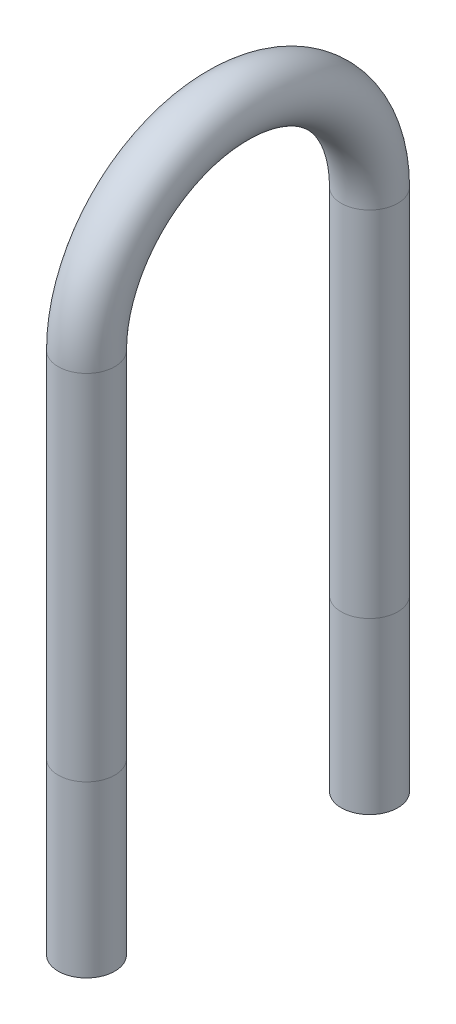
ISO-10303-21;
HEADER;
FILE_DESCRIPTION(('STEP AP214'),'2;1');
FILE_NAME('part.step','',(''),(''),'','','');
FILE_SCHEMA(('AUTOMOTIVE_DESIGN { 1 0 10303 214 1 1 1 1 }'));
ENDSEC;
DATA;
#1=APPLICATION_CONTEXT('core data for automotive mechanical design processes');
#2=APPLICATION_PROTOCOL_DEFINITION('international standard','automotive_design',2000,#1);
#3=PRODUCT_CONTEXT('',#1,'mechanical');
#4=PRODUCT('Part','Part','',(#3));
#5=PRODUCT_RELATED_PRODUCT_CATEGORY('part','',(#4));
#6=PRODUCT_DEFINITION_FORMATION('','',#4);
#7=PRODUCT_DEFINITION_CONTEXT('part definition',#1,'design');
#8=PRODUCT_DEFINITION('design','',#6,#7);
#9=PRODUCT_DEFINITION_SHAPE('','',#8);
#10=(LENGTH_UNIT() NAMED_UNIT(*) SI_UNIT(.MILLI.,.METRE.));
#11=(NAMED_UNIT(*) PLANE_ANGLE_UNIT() SI_UNIT($,.RADIAN.));
#12=(NAMED_UNIT(*) SI_UNIT($,.STERADIAN.) SOLID_ANGLE_UNIT());
#13=UNCERTAINTY_MEASURE_WITH_UNIT(LENGTH_MEASURE(1.E-05),#10,'distance_accuracy_value','');
#14=(GEOMETRIC_REPRESENTATION_CONTEXT(3) GLOBAL_UNCERTAINTY_ASSIGNED_CONTEXT((#13)) GLOBAL_UNIT_ASSIGNED_CONTEXT((#10,
#11,#12)) REPRESENTATION_CONTEXT('',''));
#15=CARTESIAN_POINT('',(0.,0.,0.));
#16=DIRECTION('',(0.,0.,1.));
#17=DIRECTION('',(1.,0.,0.));
#18=AXIS2_PLACEMENT_3D('',#15,#16,#17);
#19=CARTESIAN_POINT('',(0.,-152.4,-254.));
#20=DIRECTION('',(0.,1.,0.));
#21=DIRECTION('',(0.,0.,1.));
#22=AXIS2_PLACEMENT_3D('',#19,#20,#21);
#23=CYLINDRICAL_SURFACE('',#22,25.4);
#24=CARTESIAN_POINT('',(0.,0.,-254.));
#25=DIRECTION('',(0.,-1.,0.));
#26=DIRECTION('',(0.,0.,-1.));
#27=AXIS2_PLACEMENT_3D('',#24,#25,#26);
#28=CIRCLE('',#27,25.4);
#29=CARTESIAN_POINT('',(0.,0.,-279.4));
#30=VERTEX_POINT('',#29);
#31=EDGE_CURVE('E57',#30,#30,#28,.T.);
#32=ORIENTED_EDGE('',*,*,#31,.T.);
#33=EDGE_LOOP('',(#32));
#34=FACE_BOUND('',#33,.T.);
#35=CARTESIAN_POINT('',(0.,-152.4,-254.));
#36=DIRECTION('',(0.,-1.,0.));
#37=DIRECTION('',(0.,0.,-1.));
#38=AXIS2_PLACEMENT_3D('',#35,#36,#37);
#39=CIRCLE('',#38,25.4);
#40=CARTESIAN_POINT('',(0.,-152.4,-279.4));
#41=VERTEX_POINT('',#40);
#42=EDGE_CURVE('E54',#41,#41,#39,.T.);
#43=ORIENTED_EDGE('',*,*,#42,.F.);
#44=EDGE_LOOP('',(#43));
#45=FACE_BOUND('',#44,.T.);
#46=ADVANCED_FACE('F33',(#34,#45),#23,.T.);
#47=CARTESIAN_POINT('',(0.,0.,-254.));
#48=DIRECTION('',(0.,1.,0.));
#49=DIRECTION('',(0.,0.,1.));
#50=AXIS2_PLACEMENT_3D('',#47,#48,#49);
#51=CYLINDRICAL_SURFACE('',#50,25.4);
#52=CARTESIAN_POINT('',(0.,317.5,-254.));
#53=DIRECTION('',(0.,-1.,0.));
#54=DIRECTION('',(0.,0.,-1.));
#55=AXIS2_PLACEMENT_3D('',#52,#53,#54);
#56=CIRCLE('',#55,25.4);
#57=CARTESIAN_POINT('',(0.,317.5,-279.4));
#58=VERTEX_POINT('',#57);
#59=EDGE_CURVE('E60',#58,#58,#56,.T.);
#60=ORIENTED_EDGE('',*,*,#59,.T.);
#61=EDGE_LOOP('',(#60));
#62=FACE_BOUND('',#61,.T.);
#63=ORIENTED_EDGE('',*,*,#31,.F.);
#64=EDGE_LOOP('',(#63));
#65=FACE_BOUND('',#64,.T.);
#66=ADVANCED_FACE('F102',(#62,#65),#51,.T.);
#67=CARTESIAN_POINT('',(0.,317.5,-127.));
#68=DIRECTION('',(1.,0.,0.));
#69=DIRECTION('',(0.,0.,-1.));
#70=AXIS2_PLACEMENT_3D('',#67,#68,#69);
#71=TOROIDAL_SURFACE('',#70,127.,25.4);
#72=CARTESIAN_POINT('',(0.,317.5,0.));
#73=DIRECTION('',(0.,1.,0.));
#74=DIRECTION('',(0.,0.,1.));
#75=AXIS2_PLACEMENT_3D('',#72,#73,#74);
#76=CIRCLE('',#75,25.4);
#77=CARTESIAN_POINT('',(0.,317.5,25.4));
#78=VERTEX_POINT('',#77);
#79=EDGE_CURVE('E62',#78,#78,#76,.T.);
#80=CARTESIAN_POINT('',(0.,317.5,-127.));
#81=DIRECTION('',(1.,0.,0.));
#82=DIRECTION('',(0.,0.,-1.));
#83=AXIS2_PLACEMENT_3D('',#80,#81,#82);
#84=CIRCLE('',#83,152.4);
#85=EDGE_CURVE('',#58,#78,#84,.T.);
#86=ORIENTED_EDGE('',*,*,#59,.F.);
#87=ORIENTED_EDGE('',*,*,#79,.T.);
#88=ORIENTED_EDGE('',*,*,#85,.T.);
#89=ORIENTED_EDGE('',*,*,#85,.F.);
#90=EDGE_LOOP('',(#86,#88,#87,#89));
#91=FACE_BOUND('',#90,.T.);
#92=ADVANCED_FACE('F82',(#91),#71,.T.);
#93=CARTESIAN_POINT('',(0.,317.5,0.));
#94=DIRECTION('',(0.,-1.,0.));
#95=DIRECTION('',(0.,0.,-1.));
#96=AXIS2_PLACEMENT_3D('',#93,#94,#95);
#97=CYLINDRICAL_SURFACE('',#96,25.4);
#98=CARTESIAN_POINT('',(0.,0.,0.));
#99=DIRECTION('',(0.,1.,0.));
#100=DIRECTION('',(0.,0.,1.));
#101=AXIS2_PLACEMENT_3D('',#98,#99,#100);
#102=CIRCLE('',#101,25.4);
#103=CARTESIAN_POINT('',(0.,0.,25.4));
#104=VERTEX_POINT('',#103);
#105=EDGE_CURVE('E37',#104,#104,#102,.T.);
#106=ORIENTED_EDGE('',*,*,#105,.T.);
#107=EDGE_LOOP('',(#106));
#108=FACE_BOUND('',#107,.T.);
#109=ORIENTED_EDGE('',*,*,#79,.F.);
#110=EDGE_LOOP('',(#109));
#111=FACE_BOUND('',#110,.T.);
#112=ADVANCED_FACE('F69',(#108,#111),#97,.T.);
#113=CARTESIAN_POINT('',(0.,0.,0.));
#114=DIRECTION('',(0.,-1.,0.));
#115=DIRECTION('',(0.,0.,-1.));
#116=AXIS2_PLACEMENT_3D('',#113,#114,#115);
#117=CYLINDRICAL_SURFACE('',#116,25.4);
#118=CARTESIAN_POINT('',(0.,-152.4,0.));
#119=DIRECTION('',(0.,1.,0.));
#120=DIRECTION('',(0.,0.,1.));
#121=AXIS2_PLACEMENT_3D('',#118,#119,#120);
#122=CIRCLE('',#121,25.4);
#123=CARTESIAN_POINT('',(0.,-152.4,25.4));
#124=VERTEX_POINT('',#123);
#125=EDGE_CURVE('E50',#124,#124,#122,.T.);
#126=ORIENTED_EDGE('',*,*,#125,.T.);
#127=EDGE_LOOP('',(#126));
#128=FACE_BOUND('',#127,.T.);
#129=ORIENTED_EDGE('',*,*,#105,.F.);
#130=EDGE_LOOP('',(#129));
#131=FACE_BOUND('',#130,.T.);
#132=ADVANCED_FACE('F35',(#128,#131),#117,.T.);
#133=CARTESIAN_POINT('',(0.,-152.4,-254.));
#134=DIRECTION('',(0.,-1.,0.));
#135=DIRECTION('',(0.,0.,-1.));
#136=AXIS2_PLACEMENT_3D('',#133,#134,#135);
#137=PLANE('',#136);
#138=CARTESIAN_POINT('',(0.,-152.4,-254.));
#139=DIRECTION('',(0.,-1.,0.));
#140=DIRECTION('',(0.,0.,-1.));
#141=AXIS2_PLACEMENT_3D('',#138,#139,#140);
#142=CIRCLE('',#141,23.749);
#143=CARTESIAN_POINT('',(0.,-152.4,-277.749));
#144=VERTEX_POINT('',#143);
#145=EDGE_CURVE('E53',#144,#144,#142,.F.);
#146=ORIENTED_EDGE('',*,*,#145,.T.);
#147=EDGE_LOOP('',(#146));
#148=FACE_BOUND('',#147,.T.);
#149=ORIENTED_EDGE('',*,*,#42,.T.);
#150=EDGE_LOOP('',(#149));
#151=FACE_BOUND('',#150,.T.);
#152=ADVANCED_FACE('F73',(#148,#151),#137,.T.);
#153=CARTESIAN_POINT('',(0.,-152.4,0.));
#154=DIRECTION('',(0.,1.,0.));
#155=DIRECTION('',(0.,0.,1.));
#156=AXIS2_PLACEMENT_3D('',#153,#154,#155);
#157=PLANE('',#156);
#158=CARTESIAN_POINT('',(0.,-152.4,0.));
#159=DIRECTION('',(0.,1.,0.));
#160=DIRECTION('',(0.,0.,1.));
#161=AXIS2_PLACEMENT_3D('',#158,#159,#160);
#162=CIRCLE('',#161,23.749);
#163=CARTESIAN_POINT('',(0.,-152.4,23.749));
#164=VERTEX_POINT('',#163);
#165=EDGE_CURVE('E10',#164,#164,#162,.F.);
#166=ORIENTED_EDGE('',*,*,#165,.F.);
#167=EDGE_LOOP('',(#166));
#168=FACE_BOUND('',#167,.T.);
#169=ORIENTED_EDGE('',*,*,#125,.F.);
#170=EDGE_LOOP('',(#169));
#171=FACE_BOUND('',#170,.T.);
#172=ADVANCED_FACE('F79',(#168,#171),#157,.F.);
#173=CARTESIAN_POINT('',(0.,-152.4,-254.));
#174=DIRECTION('',(0.,1.,0.));
#175=DIRECTION('',(0.,0.,1.));
#176=AXIS2_PLACEMENT_3D('',#173,#174,#175);
#177=CYLINDRICAL_SURFACE('',#176,23.749);
#178=CARTESIAN_POINT('',(0.,0.,-254.));
#179=DIRECTION('',(0.,-1.,0.));
#180=DIRECTION('',(0.,0.,-1.));
#181=AXIS2_PLACEMENT_3D('',#178,#179,#180);
#182=CIRCLE('',#181,23.749);
#183=CARTESIAN_POINT('',(0.,0.,-277.749));
#184=VERTEX_POINT('',#183);
#185=EDGE_CURVE('E186',#184,#184,#182,.F.);
#186=ORIENTED_EDGE('',*,*,#185,.T.);
#187=EDGE_LOOP('',(#186));
#188=FACE_BOUND('',#187,.T.);
#189=ORIENTED_EDGE('',*,*,#145,.F.);
#190=EDGE_LOOP('',(#189));
#191=FACE_BOUND('',#190,.T.);
#192=ADVANCED_FACE('F97',(#188,#191),#177,.F.);
#193=CARTESIAN_POINT('',(0.,0.,-254.));
#194=DIRECTION('',(0.,1.,0.));
#195=DIRECTION('',(0.,0.,1.));
#196=AXIS2_PLACEMENT_3D('',#193,#194,#195);
#197=CYLINDRICAL_SURFACE('',#196,23.749);
#198=CARTESIAN_POINT('',(0.,317.5,-254.));
#199=DIRECTION('',(0.,-1.,0.));
#200=DIRECTION('',(0.,0.,-1.));
#201=AXIS2_PLACEMENT_3D('',#198,#199,#200);
#202=CIRCLE('',#201,23.749);
#203=CARTESIAN_POINT('',(0.,317.5,-277.749));
#204=VERTEX_POINT('',#203);
#205=EDGE_CURVE('E185',#204,#204,#202,.F.);
#206=ORIENTED_EDGE('',*,*,#205,.T.);
#207=EDGE_LOOP('',(#206));
#208=FACE_BOUND('',#207,.T.);
#209=ORIENTED_EDGE('',*,*,#185,.F.);
#210=EDGE_LOOP('',(#209));
#211=FACE_BOUND('',#210,.T.);
#212=ADVANCED_FACE('F148',(#208,#211),#197,.F.);
#213=CARTESIAN_POINT('',(0.,317.5,-127.));
#214=DIRECTION('',(1.,0.,0.));
#215=DIRECTION('',(0.,0.,-1.));
#216=AXIS2_PLACEMENT_3D('',#213,#214,#215);
#217=TOROIDAL_SURFACE('',#216,127.,23.749);
#218=CARTESIAN_POINT('',(0.,317.5,0.));
#219=DIRECTION('',(0.,1.,0.));
#220=DIRECTION('',(0.,0.,1.));
#221=AXIS2_PLACEMENT_3D('',#218,#219,#220);
#222=CIRCLE('',#221,23.749);
#223=CARTESIAN_POINT('',(0.,317.5,23.749));
#224=VERTEX_POINT('',#223);
#225=EDGE_CURVE('E46',#224,#224,#222,.F.);
#226=CARTESIAN_POINT('',(0.,317.5,-127.));
#227=DIRECTION('',(1.,0.,0.));
#228=DIRECTION('',(0.,0.,-1.));
#229=AXIS2_PLACEMENT_3D('',#226,#227,#228);
#230=CIRCLE('',#229,150.749);
#231=EDGE_CURVE('',#204,#224,#230,.T.);
#232=ORIENTED_EDGE('',*,*,#205,.F.);
#233=ORIENTED_EDGE('',*,*,#225,.T.);
#234=ORIENTED_EDGE('',*,*,#231,.T.);
#235=ORIENTED_EDGE('',*,*,#231,.F.);
#236=EDGE_LOOP('',(#232,#234,#233,#235));
#237=FACE_BOUND('',#236,.T.);
#238=ADVANCED_FACE('F90',(#237),#217,.F.);
#239=CARTESIAN_POINT('',(0.,317.5,0.));
#240=DIRECTION('',(0.,-1.,0.));
#241=DIRECTION('',(0.,0.,-1.));
#242=AXIS2_PLACEMENT_3D('',#239,#240,#241);
#243=CYLINDRICAL_SURFACE('',#242,23.749);
#244=CARTESIAN_POINT('',(0.,0.,0.));
#245=DIRECTION('',(0.,1.,0.));
#246=DIRECTION('',(0.,0.,1.));
#247=AXIS2_PLACEMENT_3D('',#244,#245,#246);
#248=CIRCLE('',#247,23.749);
#249=CARTESIAN_POINT('',(0.,0.,23.749));
#250=VERTEX_POINT('',#249);
#251=EDGE_CURVE('E41',#250,#250,#248,.F.);
#252=ORIENTED_EDGE('',*,*,#251,.T.);
#253=EDGE_LOOP('',(#252));
#254=FACE_BOUND('',#253,.T.);
#255=ORIENTED_EDGE('',*,*,#225,.F.);
#256=EDGE_LOOP('',(#255));
#257=FACE_BOUND('',#256,.T.);
#258=ADVANCED_FACE('F85',(#254,#257),#243,.F.);
#259=CARTESIAN_POINT('',(0.,0.,0.));
#260=DIRECTION('',(0.,-1.,0.));
#261=DIRECTION('',(0.,0.,-1.));
#262=AXIS2_PLACEMENT_3D('',#259,#260,#261);
#263=CYLINDRICAL_SURFACE('',#262,23.749);
#264=ORIENTED_EDGE('',*,*,#165,.T.);
#265=EDGE_LOOP('',(#264));
#266=FACE_BOUND('',#265,.T.);
#267=ORIENTED_EDGE('',*,*,#251,.F.);
#268=EDGE_LOOP('',(#267));
#269=FACE_BOUND('',#268,.T.);
#270=ADVANCED_FACE('F83',(#266,#269),#263,.F.);
#271=CLOSED_SHELL('',(#46,#66,#92,#112,#132,#152,#172,#192,#212,#238,#258,#270));
#272=MANIFOLD_SOLID_BREP('B2',#271);
#273=ADVANCED_BREP_SHAPE_REPRESENTATION('',(#18,#272),#14);
#274=SHAPE_DEFINITION_REPRESENTATION(#9,#273);
ENDSEC;
END-ISO-10303-21;
